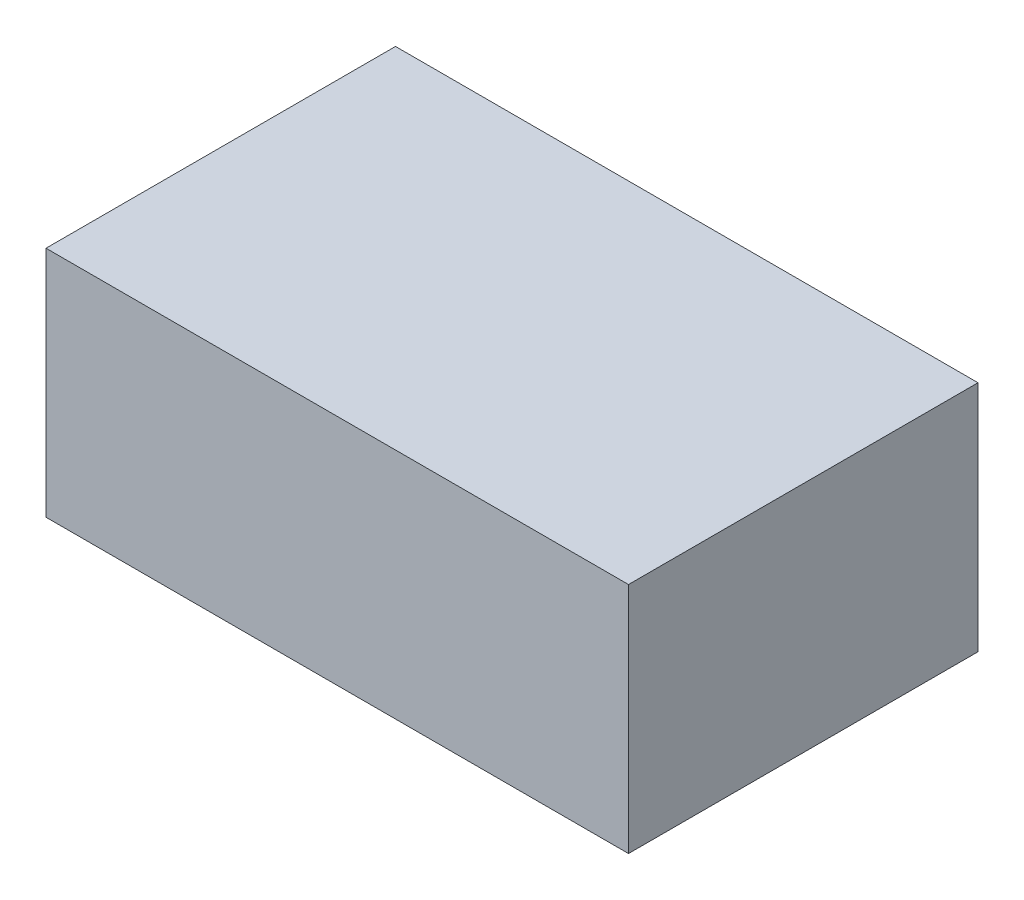
ISO-10303-21;
HEADER;
FILE_DESCRIPTION(('STEP AP214'),'2;1');
FILE_NAME('part.step','',(''),(''),'','','');
FILE_SCHEMA(('AUTOMOTIVE_DESIGN { 1 0 10303 214 1 1 1 1 }'));
ENDSEC;
DATA;
#1=APPLICATION_CONTEXT('core data for automotive mechanical design processes');
#2=APPLICATION_PROTOCOL_DEFINITION('international standard','automotive_design',2000,#1);
#3=PRODUCT_CONTEXT('',#1,'mechanical');
#4=PRODUCT('Part','Part','',(#3));
#5=PRODUCT_RELATED_PRODUCT_CATEGORY('part','',(#4));
#6=PRODUCT_DEFINITION_FORMATION('','',#4);
#7=PRODUCT_DEFINITION_CONTEXT('part definition',#1,'design');
#8=PRODUCT_DEFINITION('design','',#6,#7);
#9=PRODUCT_DEFINITION_SHAPE('','',#8);
#10=(LENGTH_UNIT() NAMED_UNIT(*) SI_UNIT(.MILLI.,.METRE.));
#11=(NAMED_UNIT(*) PLANE_ANGLE_UNIT() SI_UNIT($,.RADIAN.));
#12=(NAMED_UNIT(*) SI_UNIT($,.STERADIAN.) SOLID_ANGLE_UNIT());
#13=UNCERTAINTY_MEASURE_WITH_UNIT(LENGTH_MEASURE(1.E-05),#10,'distance_accuracy_value','');
#14=(GEOMETRIC_REPRESENTATION_CONTEXT(3) GLOBAL_UNCERTAINTY_ASSIGNED_CONTEXT((#13)) GLOBAL_UNIT_ASSIGNED_CONTEXT((#10,
#11,#12)) REPRESENTATION_CONTEXT('',''));
#15=CARTESIAN_POINT('',(0.,0.,0.));
#16=DIRECTION('',(0.,0.,1.));
#17=DIRECTION('',(1.,0.,0.));
#18=AXIS2_PLACEMENT_3D('',#15,#16,#17);
#19=CARTESIAN_POINT('',(-15.875,6.35,19.05));
#20=DIRECTION('',(1.,0.,0.));
#21=DIRECTION('',(0.,0.,-1.));
#22=AXIS2_PLACEMENT_3D('',#19,#20,#21);
#23=PLANE('',#22);
#24=DIRECTION('',(0.,-1.,0.));
#25=VECTOR('',#24,1.);
#26=CARTESIAN_POINT('',(-15.875,6.35,0.));
#27=LINE('',#26,#25);
#28=CARTESIAN_POINT('',(-15.875,6.35,0.));
#29=VERTEX_POINT('',#28);
#30=CARTESIAN_POINT('',(-15.875,-6.35,0.));
#31=VERTEX_POINT('',#30);
#32=EDGE_CURVE('E97',#29,#31,#27,.T.);
#33=ORIENTED_EDGE('',*,*,#32,.T.);
#34=DIRECTION('',(0.,0.,-1.));
#35=VECTOR('',#34,1.);
#36=CARTESIAN_POINT('',(-15.875,-6.35,19.05));
#37=LINE('',#36,#35);
#38=CARTESIAN_POINT('',(-15.875,-6.35,19.05));
#39=VERTEX_POINT('',#38);
#40=EDGE_CURVE('E11',#39,#31,#37,.T.);
#41=ORIENTED_EDGE('',*,*,#40,.F.);
#42=DIRECTION('',(0.,-1.,0.));
#43=VECTOR('',#42,1.);
#44=CARTESIAN_POINT('',(-15.875,6.35,19.05));
#45=LINE('',#44,#43);
#46=CARTESIAN_POINT('',(-15.875,6.35,19.05));
#47=VERTEX_POINT('',#46);
#48=EDGE_CURVE('E85',#47,#39,#45,.T.);
#49=ORIENTED_EDGE('',*,*,#48,.F.);
#50=DIRECTION('',(0.,0.,-1.));
#51=VECTOR('',#50,1.);
#52=CARTESIAN_POINT('',(-15.875,6.35,19.05));
#53=LINE('',#52,#51);
#54=EDGE_CURVE('E93',#47,#29,#53,.T.);
#55=ORIENTED_EDGE('',*,*,#54,.T.);
#56=EDGE_LOOP('',(#33,#41,#49,#55));
#57=FACE_BOUND('',#56,.T.);
#58=ADVANCED_FACE('F34',(#57),#23,.F.);
#59=CARTESIAN_POINT('',(15.875,-6.35,19.05));
#60=DIRECTION('',(0.,1.,0.));
#61=DIRECTION('',(-1.,0.,0.));
#62=AXIS2_PLACEMENT_3D('',#59,#60,#61);
#63=PLANE('',#62);
#64=DIRECTION('',(1.,0.,0.));
#65=VECTOR('',#64,1.);
#66=CARTESIAN_POINT('',(15.875,-6.35,0.));
#67=LINE('',#66,#65);
#68=CARTESIAN_POINT('',(15.875,-6.35,0.));
#69=VERTEX_POINT('',#68);
#70=EDGE_CURVE('E89',#31,#69,#67,.T.);
#71=ORIENTED_EDGE('',*,*,#70,.T.);
#72=DIRECTION('',(0.,0.,-1.));
#73=VECTOR('',#72,1.);
#74=CARTESIAN_POINT('',(15.875,-6.35,19.05));
#75=LINE('',#74,#73);
#76=CARTESIAN_POINT('',(15.875,-6.35,19.05));
#77=VERTEX_POINT('',#76);
#78=EDGE_CURVE('E42',#77,#69,#75,.T.);
#79=ORIENTED_EDGE('',*,*,#78,.F.);
#80=DIRECTION('',(1.,0.,0.));
#81=VECTOR('',#80,1.);
#82=CARTESIAN_POINT('',(15.875,-6.35,19.05));
#83=LINE('',#82,#81);
#84=EDGE_CURVE('E80',#39,#77,#83,.T.);
#85=ORIENTED_EDGE('',*,*,#84,.F.);
#86=ORIENTED_EDGE('',*,*,#40,.T.);
#87=EDGE_LOOP('',(#71,#79,#85,#86));
#88=FACE_BOUND('',#87,.T.);
#89=ADVANCED_FACE('F88',(#88),#63,.F.);
#90=CARTESIAN_POINT('',(15.875,6.35,19.05));
#91=DIRECTION('',(-1.,0.,0.));
#92=DIRECTION('',(0.,0.,1.));
#93=AXIS2_PLACEMENT_3D('',#90,#91,#92);
#94=PLANE('',#93);
#95=DIRECTION('',(0.,1.,0.));
#96=VECTOR('',#95,1.);
#97=CARTESIAN_POINT('',(15.875,6.35,0.));
#98=LINE('',#97,#96);
#99=CARTESIAN_POINT('',(15.875,6.35,0.));
#100=VERTEX_POINT('',#99);
#101=EDGE_CURVE('E67',#69,#100,#98,.T.);
#102=ORIENTED_EDGE('',*,*,#101,.T.);
#103=DIRECTION('',(0.,0.,-1.));
#104=VECTOR('',#103,1.);
#105=CARTESIAN_POINT('',(15.875,6.35,19.05));
#106=LINE('',#105,#104);
#107=CARTESIAN_POINT('',(15.875,6.35,19.05));
#108=VERTEX_POINT('',#107);
#109=EDGE_CURVE('E90',#108,#100,#106,.T.);
#110=ORIENTED_EDGE('',*,*,#109,.F.);
#111=DIRECTION('',(0.,1.,0.));
#112=VECTOR('',#111,1.);
#113=CARTESIAN_POINT('',(15.875,6.35,19.05));
#114=LINE('',#113,#112);
#115=EDGE_CURVE('E83',#77,#108,#114,.T.);
#116=ORIENTED_EDGE('',*,*,#115,.F.);
#117=ORIENTED_EDGE('',*,*,#78,.T.);
#118=EDGE_LOOP('',(#102,#110,#116,#117));
#119=FACE_BOUND('',#118,.T.);
#120=ADVANCED_FACE('F91',(#119),#94,.F.);
#121=CARTESIAN_POINT('',(15.875,6.35,19.05));
#122=DIRECTION('',(0.,-1.,0.));
#123=DIRECTION('',(1.,0.,0.));
#124=AXIS2_PLACEMENT_3D('',#121,#122,#123);
#125=PLANE('',#124);
#126=DIRECTION('',(-1.,0.,0.));
#127=VECTOR('',#126,1.);
#128=CARTESIAN_POINT('',(15.875,6.35,0.));
#129=LINE('',#128,#127);
#130=EDGE_CURVE('E73',#100,#29,#129,.T.);
#131=ORIENTED_EDGE('',*,*,#130,.T.);
#132=ORIENTED_EDGE('',*,*,#54,.F.);
#133=DIRECTION('',(-1.,0.,0.));
#134=VECTOR('',#133,1.);
#135=CARTESIAN_POINT('',(15.875,6.35,19.05));
#136=LINE('',#135,#134);
#137=EDGE_CURVE('E50',#108,#47,#136,.T.);
#138=ORIENTED_EDGE('',*,*,#137,.F.);
#139=ORIENTED_EDGE('',*,*,#109,.T.);
#140=EDGE_LOOP('',(#131,#132,#138,#139));
#141=FACE_BOUND('',#140,.T.);
#142=ADVANCED_FACE('F104',(#141),#125,.F.);
#143=CARTESIAN_POINT('',(-15.875,-6.35,19.05));
#144=DIRECTION('',(0.,0.,-1.));
#145=DIRECTION('',(-1.,0.,0.));
#146=AXIS2_PLACEMENT_3D('',#143,#144,#145);
#147=PLANE('',#146);
#148=ORIENTED_EDGE('',*,*,#48,.T.);
#149=ORIENTED_EDGE('',*,*,#84,.T.);
#150=ORIENTED_EDGE('',*,*,#115,.T.);
#151=ORIENTED_EDGE('',*,*,#137,.T.);
#152=EDGE_LOOP('',(#148,#149,#150,#151));
#153=FACE_BOUND('',#152,.T.);
#154=ADVANCED_FACE('F81',(#153),#147,.F.);
#155=CARTESIAN_POINT('',(-15.875,-6.35,0.));
#156=DIRECTION('',(0.,0.,-1.));
#157=DIRECTION('',(-1.,0.,0.));
#158=AXIS2_PLACEMENT_3D('',#155,#156,#157);
#159=PLANE('',#158);
#160=ORIENTED_EDGE('',*,*,#32,.F.);
#161=ORIENTED_EDGE('',*,*,#130,.F.);
#162=ORIENTED_EDGE('',*,*,#101,.F.);
#163=ORIENTED_EDGE('',*,*,#70,.F.);
#164=EDGE_LOOP('',(#160,#161,#162,#163));
#165=FACE_BOUND('',#164,.T.);
#166=ADVANCED_FACE('F107',(#165),#159,.T.);
#167=CLOSED_SHELL('',(#58,#89,#120,#142,#154,#166));
#168=MANIFOLD_SOLID_BREP('B2',#167);
#169=ADVANCED_BREP_SHAPE_REPRESENTATION('',(#18,#168),#14);
#170=SHAPE_DEFINITION_REPRESENTATION(#9,#169);
ENDSEC;
END-ISO-10303-21;
